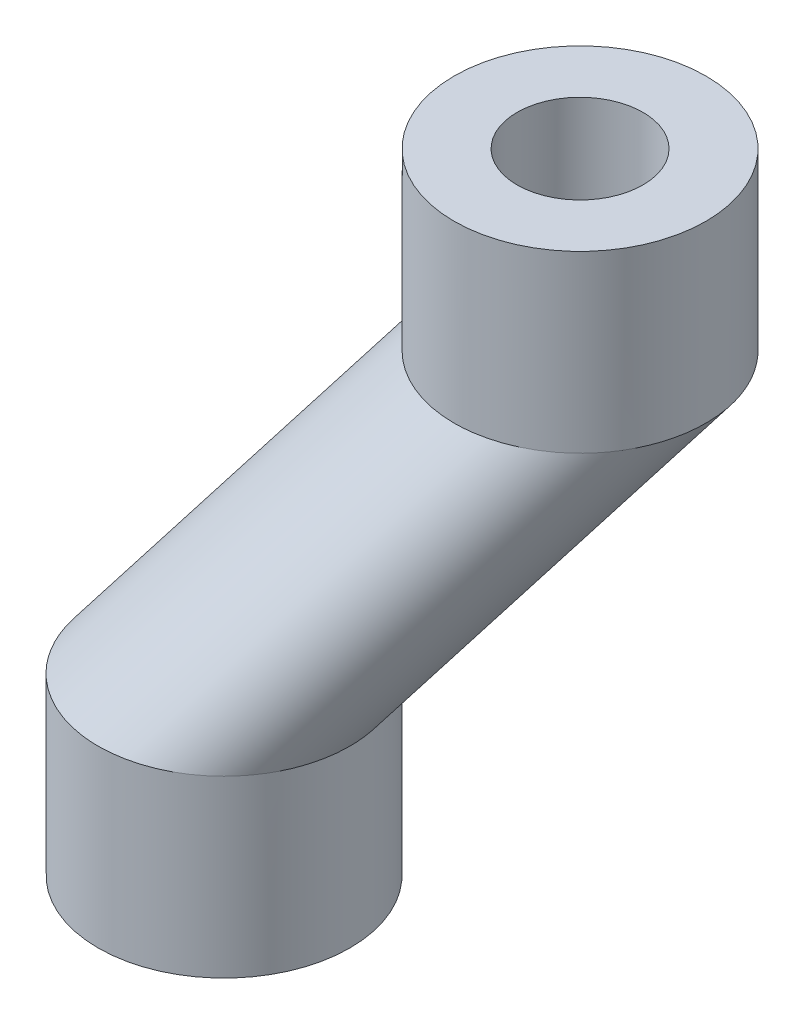
ISO-10303-21;
HEADER;
FILE_DESCRIPTION(('STEP AP214'),'2;1');
FILE_NAME('part.step','',(''),(''),'','','');
FILE_SCHEMA(('AUTOMOTIVE_DESIGN { 1 0 10303 214 1 1 1 1 }'));
ENDSEC;
DATA;
#1=APPLICATION_CONTEXT('core data for automotive mechanical design processes');
#2=APPLICATION_PROTOCOL_DEFINITION('international standard','automotive_design',2000,#1);
#3=PRODUCT_CONTEXT('',#1,'mechanical');
#4=PRODUCT('Part','Part','',(#3));
#5=PRODUCT_RELATED_PRODUCT_CATEGORY('part','',(#4));
#6=PRODUCT_DEFINITION_FORMATION('','',#4);
#7=PRODUCT_DEFINITION_CONTEXT('part definition',#1,'design');
#8=PRODUCT_DEFINITION('design','',#6,#7);
#9=PRODUCT_DEFINITION_SHAPE('','',#8);
#10=(LENGTH_UNIT() NAMED_UNIT(*) SI_UNIT(.MILLI.,.METRE.));
#11=(NAMED_UNIT(*) PLANE_ANGLE_UNIT() SI_UNIT($,.RADIAN.));
#12=(NAMED_UNIT(*) SI_UNIT($,.STERADIAN.) SOLID_ANGLE_UNIT());
#13=UNCERTAINTY_MEASURE_WITH_UNIT(LENGTH_MEASURE(1.E-05),#10,'distance_accuracy_value','');
#14=(GEOMETRIC_REPRESENTATION_CONTEXT(3) GLOBAL_UNCERTAINTY_ASSIGNED_CONTEXT((#13)) GLOBAL_UNIT_ASSIGNED_CONTEXT((#10,
#11,#12)) REPRESENTATION_CONTEXT('',''));
#15=CARTESIAN_POINT('',(0.,0.,0.));
#16=DIRECTION('',(0.,0.,1.));
#17=DIRECTION('',(1.,0.,0.));
#18=AXIS2_PLACEMENT_3D('',#15,#16,#17);
#19=CARTESIAN_POINT('',(0.,0.,18.));
#20=CARTESIAN_POINT('',(25.4558441227157,40.,-7.45584412271576));
#21=CARTESIAN_POINT('',(-0.749999999999999,0.,18.));
#22=CARTESIAN_POINT('',(24.7058441227157,40.,-7.45584412271576));
#23=CARTESIAN_POINT('',(-1.54734121700995,0.,17.9534810870076));
#24=CARTESIAN_POINT('',(23.9085029057057,40.,-7.50236303570817));
#25=CARTESIAN_POINT('',(-3.23141984493696,0.,17.7279348421959));
#26=CARTESIAN_POINT('',(22.2244242777787,40.,-7.72790928051982));
#27=CARTESIAN_POINT('',(-4.1184,0.,17.5488));
#28=CARTESIAN_POINT('',(21.3374441227157,40.,-7.90704412271576));
#29=CARTESIAN_POINT('',(-5.9616,0.,17.0112));
#30=CARTESIAN_POINT('',(19.4942441227157,40.,-8.44464412271576));
#31=CARTESIAN_POINT('',(-6.91806590077011,0.,16.6524428733746));
#32=CARTESIAN_POINT('',(18.5377782219456,40.,-8.80340124934119));
#33=CARTESIAN_POINT('',(-8.8572149981063,0.,15.7071076884232));
#34=CARTESIAN_POINT('',(16.5986291246094,40.,-9.74873643429258));
#35=CARTESIAN_POINT('',(-9.84000000000001,0.,15.12));
#36=CARTESIAN_POINT('',(15.6158441227157,40.,-10.3358441227158));
#37=CARTESIAN_POINT('',(-11.76,0.,13.68));
#38=CARTESIAN_POINT('',(13.6958441227157,40.,-11.7758441227158));
#39=CARTESIAN_POINT('',(-12.6969412647776,0.,12.8264214674423));
#40=CARTESIAN_POINT('',(12.758902857938,40.,-12.6294226552735));
#41=CARTESIAN_POINT('',(-14.4263464064552,0.,10.84481140927));
#42=CARTESIAN_POINT('',(11.0294977162604,40.,-14.6110327134457));
#43=CARTESIAN_POINT('',(-15.2179930795848,0.,9.71626297577855));
#44=CARTESIAN_POINT('',(10.2378510431309,40.,-15.7395811469372));
#45=CARTESIAN_POINT('',(-16.5467128027682,0.,7.22491349480969));
#46=CARTESIAN_POINT('',(8.9091313199475,40.,-18.2309306279061));
#47=CARTESIAN_POINT('',(-17.0826035502959,0.,5.86224852071006));
#48=CARTESIAN_POINT('',(8.3732405724198,40.,-19.5935956020057));
#49=CARTESIAN_POINT('',(-17.8097041420118,0.,2.9992899408284));
#50=CARTESIAN_POINT('',(7.64613998070383,40.,-22.4565541818874));
#51=CARTESIAN_POINT('',(-18.,0.,1.5));
#52=CARTESIAN_POINT('',(7.45584412271567,40.,-23.9558441227157));
#53=CARTESIAN_POINT('',(-18.,0.,-1.5));
#54=CARTESIAN_POINT('',(7.45584412271567,40.,-26.9558441227158));
#55=CARTESIAN_POINT('',(-17.8097041420118,0.,-2.9992899408284));
#56=CARTESIAN_POINT('',(7.64613998070384,40.,-28.4551340635441));
#57=CARTESIAN_POINT('',(-17.0826035502959,0.,-5.86224852071006));
#58=CARTESIAN_POINT('',(8.37324057241981,40.,-31.3180926434258));
#59=CARTESIAN_POINT('',(-16.5467128027682,0.,-7.22491349480969));
#60=CARTESIAN_POINT('',(8.9091313199475,40.,-32.6807576175254));
#61=CARTESIAN_POINT('',(-15.2179930795848,0.,-9.71626297577855));
#62=CARTESIAN_POINT('',(10.2378510431309,40.,-35.1721070984943));
#63=CARTESIAN_POINT('',(-14.4263464064552,0.,-10.84481140927));
#64=CARTESIAN_POINT('',(11.0294977162604,40.,-36.3006555319858));
#65=CARTESIAN_POINT('',(-12.6969412647776,0.,-12.8264214674423));
#66=CARTESIAN_POINT('',(12.758902857938,40.,-38.282265590158));
#67=CARTESIAN_POINT('',(-11.76,0.,-13.68));
#68=CARTESIAN_POINT('',(13.6958441227157,40.,-39.1358441227158));
#69=CARTESIAN_POINT('',(-9.84,0.,-15.12));
#70=CARTESIAN_POINT('',(15.6158441227157,40.,-40.5758441227158));
#71=CARTESIAN_POINT('',(-8.8572149981063,0.,-15.7071076884232));
#72=CARTESIAN_POINT('',(16.5986291246094,40.,-41.1629518111389));
#73=CARTESIAN_POINT('',(-6.9180659007701,0.,-16.6524428733746));
#74=CARTESIAN_POINT('',(18.5377782219456,40.,-42.1082869960903));
#75=CARTESIAN_POINT('',(-5.9616,0.,-17.0112));
#76=CARTESIAN_POINT('',(19.4942441227157,40.,-42.4670441227158));
#77=CARTESIAN_POINT('',(-4.1184,0.,-17.5488));
#78=CARTESIAN_POINT('',(21.3374441227157,40.,-43.0046441227158));
#79=CARTESIAN_POINT('',(-3.23141984493695,0.,-17.7279348421959));
#80=CARTESIAN_POINT('',(22.2244242777787,40.,-43.1837789649117));
#81=CARTESIAN_POINT('',(-1.54734121700994,0.,-17.9534810870076));
#82=CARTESIAN_POINT('',(23.9085029057057,40.,-43.4093252097233));
#83=CARTESIAN_POINT('',(-0.749999999999998,0.,-18.));
#84=CARTESIAN_POINT('',(24.7058441227157,40.,-43.4558441227157));
#85=CARTESIAN_POINT('',(0.750000000000002,0.,-18.));
#86=CARTESIAN_POINT('',(26.2058441227157,40.,-43.4558441227157));
#87=CARTESIAN_POINT('',(1.54734121700995,0.,-17.9534810870076));
#88=CARTESIAN_POINT('',(27.0031853397256,40.,-43.4093252097233));
#89=CARTESIAN_POINT('',(3.23141984493696,0.,-17.7279348421959));
#90=CARTESIAN_POINT('',(28.6872639676526,40.,-43.1837789649117));
#91=CARTESIAN_POINT('',(4.1184,0.,-17.5488));
#92=CARTESIAN_POINT('',(29.5742441227157,40.,-43.0046441227158));
#93=CARTESIAN_POINT('',(5.9616,0.,-17.0112));
#94=CARTESIAN_POINT('',(31.4174441227157,40.,-42.4670441227158));
#95=CARTESIAN_POINT('',(6.91806590077011,0.,-16.6524428733746));
#96=CARTESIAN_POINT('',(32.3739100234858,40.,-42.1082869960903));
#97=CARTESIAN_POINT('',(8.8572149981063,0.,-15.7071076884232));
#98=CARTESIAN_POINT('',(34.313059120822,40.,-41.1629518111389));
#99=CARTESIAN_POINT('',(9.84,0.,-15.12));
#100=CARTESIAN_POINT('',(35.2958441227157,40.,-40.5758441227158));
#101=CARTESIAN_POINT('',(11.76,0.,-13.68));
#102=CARTESIAN_POINT('',(37.2158441227156,40.,-39.1358441227158));
#103=CARTESIAN_POINT('',(12.6969412647776,0.,-12.8264214674423));
#104=CARTESIAN_POINT('',(38.1527853874933,40.,-38.282265590158));
#105=CARTESIAN_POINT('',(14.4263464064552,0.,-10.84481140927));
#106=CARTESIAN_POINT('',(39.8821905291709,40.,-36.3006555319858));
#107=CARTESIAN_POINT('',(15.2179930795848,0.,-9.71626297577855));
#108=CARTESIAN_POINT('',(40.6738372023004,40.,-35.1721070984943));
#109=CARTESIAN_POINT('',(16.5467128027682,0.,-7.22491349480969));
#110=CARTESIAN_POINT('',(42.0025569254838,40.,-32.6807576175254));
#111=CARTESIAN_POINT('',(17.0826035502959,0.,-5.86224852071007));
#112=CARTESIAN_POINT('',(42.5384476730115,40.,-31.3180926434258));
#113=CARTESIAN_POINT('',(17.8097041420118,0.,-2.9992899408284));
#114=CARTESIAN_POINT('',(43.2655482647275,40.,-28.4551340635442));
#115=CARTESIAN_POINT('',(18.,0.,-1.49999999999999));
#116=CARTESIAN_POINT('',(43.4558441227157,40.,-26.9558441227158));
#117=CARTESIAN_POINT('',(18.,0.,1.5));
#118=CARTESIAN_POINT('',(43.4558441227157,40.,-23.9558441227157));
#119=CARTESIAN_POINT('',(17.8097041420118,0.,2.99928994082841));
#120=CARTESIAN_POINT('',(43.2655482647275,40.,-22.4565541818874));
#121=CARTESIAN_POINT('',(17.0826035502959,0.,5.86224852071006));
#122=CARTESIAN_POINT('',(42.5384476730115,40.,-19.5935956020057));
#123=CARTESIAN_POINT('',(16.5467128027682,0.,7.22491349480969));
#124=CARTESIAN_POINT('',(42.0025569254838,40.,-18.2309306279061));
#125=CARTESIAN_POINT('',(15.2179930795848,0.,9.71626297577855));
#126=CARTESIAN_POINT('',(40.6738372023004,40.,-15.7395811469372));
#127=CARTESIAN_POINT('',(14.4263464064552,0.,10.84481140927));
#128=CARTESIAN_POINT('',(39.8821905291709,40.,-14.6110327134457));
#129=CARTESIAN_POINT('',(12.6969412647776,0.,12.8264214674423));
#130=CARTESIAN_POINT('',(38.1527853874933,40.,-12.6294226552735));
#131=CARTESIAN_POINT('',(11.76,0.,13.68));
#132=CARTESIAN_POINT('',(37.2158441227157,40.,-11.7758441227158));
#133=CARTESIAN_POINT('',(9.84,0.,15.12));
#134=CARTESIAN_POINT('',(35.2958441227157,40.,-10.3358441227158));
#135=CARTESIAN_POINT('',(8.8572149981063,0.,15.7071076884232));
#136=CARTESIAN_POINT('',(34.313059120822,40.,-9.74873643429259));
#137=CARTESIAN_POINT('',(6.91806590077011,0.,16.6524428733746));
#138=CARTESIAN_POINT('',(32.3739100234858,40.,-8.80340124934119));
#139=CARTESIAN_POINT('',(5.9616,0.,17.0112));
#140=CARTESIAN_POINT('',(31.4174441227157,40.,-8.44464412271576));
#141=CARTESIAN_POINT('',(4.1184,0.,17.5488));
#142=CARTESIAN_POINT('',(29.5742441227157,40.,-7.90704412271576));
#143=CARTESIAN_POINT('',(3.23141984493695,0.,17.7279348421959));
#144=CARTESIAN_POINT('',(28.6872639676526,40.,-7.72790928051982));
#145=CARTESIAN_POINT('',(1.54734121700995,0.,17.9534810870076));
#146=CARTESIAN_POINT('',(27.0031853397256,40.,-7.50236303570817));
#147=CARTESIAN_POINT('',(0.750000000000003,0.,18.));
#148=CARTESIAN_POINT('',(26.2058441227157,40.,-7.45584412271576));
#149=CARTESIAN_POINT('',(0.,0.,18.));
#150=CARTESIAN_POINT('',(25.4558441227157,40.,-7.45584412271576));
#151=B_SPLINE_SURFACE_WITH_KNOTS('',3,1,((#19,#20),(#21,#22),(#23,#24),(#25,#26),(#27,#28),(#29,
#30),(#31,#32),(#33,#34),(#35,#36),(#37,#38),(#39,#40),(#41,#42),(#43,#44),(#45,#46),(#47,#48),
(#49,#50),(#51,#52),(#53,#54),(#55,#56),(#57,#58),(#59,#60),(#61,#62),(#63,#64),(#65,#66),(#67,
#68),(#69,#70),(#71,#72),(#73,#74),(#75,#76),(#77,#78),(#79,#80),(#81,#82),(#83,#84),(#85,#86),
(#87,#88),(#89,#90),(#91,#92),(#93,#94),(#95,#96),(#97,#98),(#99,#100),(#101,#102),(#103,#104),
(#105,#106),(#107,#108),(#109,#110),(#111,#112),(#113,#114),(#115,#116),(#117,#118),(#119,#120),
(#121,#122),(#123,#124),(#125,#126),(#127,#128),(#129,#130),(#131,#132),(#133,#134),(#135,#136),
(#137,#138),(#139,#140),(#141,#142),(#143,#144),(#145,#146),(#147,#148),(#149,#150)),
.UNSPECIFIED.,.T.,.F.,.F.,(4,2,2,2,2,2,2,2,2,2,2,2,2,2,2,2,2,2,2,2,2,2,2,2,2,2,2,2,2,2,2,2,4),
(2,2),(0.,0.03125,0.0625,0.09375,0.125,0.15625,0.1875,0.21875,0.25,0.28125,0.3125,0.34375,0.375,
0.40625,0.4375,0.46875,0.5,0.53125,0.5625,0.59375,0.625,0.65625,0.6875,0.71875,0.75,0.78125,
0.8125,0.84375,0.875,0.90625,0.9375,0.96875,1.),(0.,1.),.UNSPECIFIED.);
#152=CARTESIAN_POINT('',(0.,0.,18.));
#153=CARTESIAN_POINT('',(0.750000000000003,0.,18.));
#154=CARTESIAN_POINT('',(1.54734121700995,0.,17.9534810870076));
#155=CARTESIAN_POINT('',(3.23141984493695,0.,17.7279348421959));
#156=CARTESIAN_POINT('',(4.1184,0.,17.5488));
#157=CARTESIAN_POINT('',(5.9616,0.,17.0112));
#158=CARTESIAN_POINT('',(6.91806590077011,0.,16.6524428733746));
#159=CARTESIAN_POINT('',(8.8572149981063,0.,15.7071076884232));
#160=CARTESIAN_POINT('',(9.84,0.,15.12));
#161=CARTESIAN_POINT('',(11.76,0.,13.68));
#162=CARTESIAN_POINT('',(12.6969412647776,0.,12.8264214674423));
#163=CARTESIAN_POINT('',(14.4263464064552,0.,10.84481140927));
#164=CARTESIAN_POINT('',(15.2179930795848,0.,9.71626297577855));
#165=CARTESIAN_POINT('',(16.5467128027682,0.,7.22491349480969));
#166=CARTESIAN_POINT('',(17.0826035502959,0.,5.86224852071006));
#167=CARTESIAN_POINT('',(17.8097041420118,0.,2.99928994082841));
#168=CARTESIAN_POINT('',(18.,0.,1.5));
#169=CARTESIAN_POINT('',(18.,0.,-1.49999999999999));
#170=CARTESIAN_POINT('',(17.8097041420118,0.,-2.9992899408284));
#171=CARTESIAN_POINT('',(17.0826035502959,0.,-5.86224852071007));
#172=CARTESIAN_POINT('',(16.5467128027682,0.,-7.22491349480969));
#173=CARTESIAN_POINT('',(15.2179930795848,0.,-9.71626297577855));
#174=CARTESIAN_POINT('',(14.4263464064552,0.,-10.84481140927));
#175=CARTESIAN_POINT('',(12.6969412647776,0.,-12.8264214674423));
#176=CARTESIAN_POINT('',(11.76,0.,-13.68));
#177=CARTESIAN_POINT('',(9.84,0.,-15.12));
#178=CARTESIAN_POINT('',(8.8572149981063,0.,-15.7071076884232));
#179=CARTESIAN_POINT('',(6.91806590077011,0.,-16.6524428733746));
#180=CARTESIAN_POINT('',(5.9616,0.,-17.0112));
#181=CARTESIAN_POINT('',(4.1184,0.,-17.5488));
#182=CARTESIAN_POINT('',(3.23141984493696,0.,-17.7279348421959));
#183=CARTESIAN_POINT('',(1.54734121700995,0.,-17.9534810870076));
#184=CARTESIAN_POINT('',(0.750000000000002,0.,-18.));
#185=CARTESIAN_POINT('',(-0.749999999999998,0.,-18.));
#186=CARTESIAN_POINT('',(-1.54734121700994,0.,-17.9534810870076));
#187=CARTESIAN_POINT('',(-3.23141984493695,0.,-17.7279348421959));
#188=CARTESIAN_POINT('',(-4.1184,0.,-17.5488));
#189=CARTESIAN_POINT('',(-5.9616,0.,-17.0112));
#190=CARTESIAN_POINT('',(-6.9180659007701,0.,-16.6524428733746));
#191=CARTESIAN_POINT('',(-8.8572149981063,0.,-15.7071076884232));
#192=CARTESIAN_POINT('',(-9.84,0.,-15.12));
#193=CARTESIAN_POINT('',(-11.76,0.,-13.68));
#194=CARTESIAN_POINT('',(-12.6969412647776,0.,-12.8264214674423));
#195=CARTESIAN_POINT('',(-14.4263464064552,0.,-10.84481140927));
#196=CARTESIAN_POINT('',(-15.2179930795848,0.,-9.71626297577855));
#197=CARTESIAN_POINT('',(-16.5467128027682,0.,-7.22491349480969));
#198=CARTESIAN_POINT('',(-17.0826035502959,0.,-5.86224852071006));
#199=CARTESIAN_POINT('',(-17.8097041420118,0.,-2.9992899408284));
#200=CARTESIAN_POINT('',(-18.,0.,-1.5));
#201=CARTESIAN_POINT('',(-18.,0.,1.5));
#202=CARTESIAN_POINT('',(-17.8097041420118,0.,2.9992899408284));
#203=CARTESIAN_POINT('',(-17.0826035502959,0.,5.86224852071006));
#204=CARTESIAN_POINT('',(-16.5467128027682,0.,7.22491349480969));
#205=CARTESIAN_POINT('',(-15.2179930795848,0.,9.71626297577855));
#206=CARTESIAN_POINT('',(-14.4263464064552,0.,10.84481140927));
#207=CARTESIAN_POINT('',(-12.6969412647776,0.,12.8264214674423));
#208=CARTESIAN_POINT('',(-11.76,0.,13.68));
#209=CARTESIAN_POINT('',(-9.84000000000001,0.,15.12));
#210=CARTESIAN_POINT('',(-8.8572149981063,0.,15.7071076884232));
#211=CARTESIAN_POINT('',(-6.91806590077011,0.,16.6524428733746));
#212=CARTESIAN_POINT('',(-5.9616,0.,17.0112));
#213=CARTESIAN_POINT('',(-4.1184,0.,17.5488));
#214=CARTESIAN_POINT('',(-3.23141984493696,0.,17.7279348421959));
#215=CARTESIAN_POINT('',(-1.54734121700995,0.,17.9534810870076));
#216=CARTESIAN_POINT('',(-0.749999999999999,0.,18.));
#217=CARTESIAN_POINT('',(0.,0.,18.));
#218=B_SPLINE_CURVE_WITH_KNOTS('',3,(#152,#153,#154,#155,#156,#157,#158,#159,#160,#161,#162,
#163,#164,#165,#166,#167,#168,#169,#170,#171,#172,#173,#174,#175,#176,#177,#178,#179,#180,#181,
#182,#183,#184,#185,#186,#187,#188,#189,#190,#191,#192,#193,#194,#195,#196,#197,#198,#199,#200,
#201,#202,#203,#204,#205,#206,#207,#208,#209,#210,#211,#212,#213,#214,#215,#216,#217),
.UNSPECIFIED.,.T.,.F.,(4,2,2,2,2,2,2,2,2,2,2,2,2,2,2,2,2,2,2,2,2,2,2,2,2,2,2,2,2,2,2,2,4),(0.,
0.0312500000000001,0.0625000000000001,0.0937500000000001,0.125,0.15625,0.1875,0.21875,0.25,
0.28125,0.3125,0.34375,0.375,0.40625,0.4375,0.46875,0.5,0.53125,0.5625,0.59375,0.625,0.65625,
0.6875,0.71875,0.75,0.78125,0.8125,0.84375,0.875,0.90625,0.9375,0.96875,1.),.UNSPECIFIED.);
#219=CARTESIAN_POINT('',(0.,0.,18.));
#220=VERTEX_POINT('',#219);
#221=EDGE_CURVE('E76',#220,#220,#218,.F.);
#222=CARTESIAN_POINT('',(25.4558441227157,40.,-7.45584412271575));
#223=CARTESIAN_POINT('',(24.7058441227157,40.,-7.45584412271575));
#224=CARTESIAN_POINT('',(23.9085029057057,40.,-7.50236303570816));
#225=CARTESIAN_POINT('',(22.2244242777787,40.,-7.72790928051981));
#226=CARTESIAN_POINT('',(21.3374441227157,40.,-7.90704412271575));
#227=CARTESIAN_POINT('',(19.4942441227157,40.,-8.44464412271575));
#228=CARTESIAN_POINT('',(18.5377782219456,40.,-8.80340124934118));
#229=CARTESIAN_POINT('',(16.5986291246094,40.,-9.74873643429257));
#230=CARTESIAN_POINT('',(15.6158441227157,40.,-10.3358441227157));
#231=CARTESIAN_POINT('',(13.6958441227157,40.,-11.7758441227158));
#232=CARTESIAN_POINT('',(12.758902857938,40.,-12.6294226552735));
#233=CARTESIAN_POINT('',(11.0294977162604,40.,-14.6110327134457));
#234=CARTESIAN_POINT('',(10.2378510431309,40.,-15.7395811469372));
#235=CARTESIAN_POINT('',(8.90913131994749,40.,-18.2309306279061));
#236=CARTESIAN_POINT('',(8.3732405724198,40.,-19.5935956020057));
#237=CARTESIAN_POINT('',(7.64613998070383,40.,-22.4565541818873));
#238=CARTESIAN_POINT('',(7.45584412271566,40.,-23.9558441227157));
#239=CARTESIAN_POINT('',(7.45584412271566,40.,-26.9558441227158));
#240=CARTESIAN_POINT('',(7.64613998070383,40.,-28.4551340635441));
#241=CARTESIAN_POINT('',(8.3732405724198,40.,-31.3180926434258));
#242=CARTESIAN_POINT('',(8.90913131994749,40.,-32.6807576175254));
#243=CARTESIAN_POINT('',(10.2378510431309,40.,-35.1721070984943));
#244=CARTESIAN_POINT('',(11.0294977162604,40.,-36.3006555319858));
#245=CARTESIAN_POINT('',(12.758902857938,40.,-38.282265590158));
#246=CARTESIAN_POINT('',(13.6958441227157,40.,-39.1358441227158));
#247=CARTESIAN_POINT('',(15.6158441227156,40.,-40.5758441227158));
#248=CARTESIAN_POINT('',(16.5986291246094,40.,-41.1629518111389));
#249=CARTESIAN_POINT('',(18.5377782219455,40.,-42.1082869960903));
#250=CARTESIAN_POINT('',(19.4942441227156,40.,-42.4670441227158));
#251=CARTESIAN_POINT('',(21.3374441227156,40.,-43.0046441227158));
#252=CARTESIAN_POINT('',(22.2244242777787,40.,-43.1837789649117));
#253=CARTESIAN_POINT('',(23.9085029057057,40.,-43.4093252097233));
#254=CARTESIAN_POINT('',(24.7058441227157,40.,-43.4558441227157));
#255=CARTESIAN_POINT('',(26.2058441227156,40.,-43.4558441227157));
#256=CARTESIAN_POINT('',(27.0031853397256,40.,-43.4093252097233));
#257=CARTESIAN_POINT('',(28.6872639676526,40.,-43.1837789649117));
#258=CARTESIAN_POINT('',(29.5742441227157,40.,-43.0046441227158));
#259=CARTESIAN_POINT('',(31.4174441227157,40.,-42.4670441227157));
#260=CARTESIAN_POINT('',(32.3739100234857,40.,-42.1082869960903));
#261=CARTESIAN_POINT('',(34.313059120822,40.,-41.1629518111389));
#262=CARTESIAN_POINT('',(35.2958441227156,40.,-40.5758441227158));
#263=CARTESIAN_POINT('',(37.2158441227156,40.,-39.1358441227158));
#264=CARTESIAN_POINT('',(38.1527853874933,40.,-38.282265590158));
#265=CARTESIAN_POINT('',(39.8821905291709,40.,-36.3006555319858));
#266=CARTESIAN_POINT('',(40.6738372023004,40.,-35.1721070984943));
#267=CARTESIAN_POINT('',(42.0025569254838,40.,-32.6807576175254));
#268=CARTESIAN_POINT('',(42.5384476730115,40.,-31.3180926434258));
#269=CARTESIAN_POINT('',(43.2655482647275,40.,-28.4551340635442));
#270=CARTESIAN_POINT('',(43.4558441227157,40.,-26.9558441227157));
#271=CARTESIAN_POINT('',(43.4558441227157,40.,-23.9558441227157));
#272=CARTESIAN_POINT('',(43.2655482647275,40.,-22.4565541818874));
#273=CARTESIAN_POINT('',(42.5384476730115,40.,-19.5935956020057));
#274=CARTESIAN_POINT('',(42.0025569254838,40.,-18.2309306279061));
#275=CARTESIAN_POINT('',(40.6738372023004,40.,-15.7395811469372));
#276=CARTESIAN_POINT('',(39.8821905291709,40.,-14.6110327134457));
#277=CARTESIAN_POINT('',(38.1527853874933,40.,-12.6294226552735));
#278=CARTESIAN_POINT('',(37.2158441227157,40.,-11.7758441227158));
#279=CARTESIAN_POINT('',(35.2958441227157,40.,-10.3358441227157));
#280=CARTESIAN_POINT('',(34.313059120822,40.,-9.74873643429258));
#281=CARTESIAN_POINT('',(32.3739100234858,40.,-8.80340124934118));
#282=CARTESIAN_POINT('',(31.4174441227157,40.,-8.44464412271575));
#283=CARTESIAN_POINT('',(29.5742441227156,40.,-7.90704412271575));
#284=CARTESIAN_POINT('',(28.6872639676526,40.,-7.72790928051981));
#285=CARTESIAN_POINT('',(27.0031853397256,40.,-7.50236303570816));
#286=CARTESIAN_POINT('',(26.2058441227157,40.,-7.45584412271575));
#287=CARTESIAN_POINT('',(25.4558441227157,40.,-7.45584412271575));
#288=B_SPLINE_CURVE_WITH_KNOTS('',3,(#222,#223,#224,#225,#226,#227,#228,#229,#230,#231,#232,
#233,#234,#235,#236,#237,#238,#239,#240,#241,#242,#243,#244,#245,#246,#247,#248,#249,#250,#251,
#252,#253,#254,#255,#256,#257,#258,#259,#260,#261,#262,#263,#264,#265,#266,#267,#268,#269,#270,
#271,#272,#273,#274,#275,#276,#277,#278,#279,#280,#281,#282,#283,#284,#285,#286,#287),
.UNSPECIFIED.,.T.,.F.,(4,2,2,2,2,2,2,2,2,2,2,2,2,2,2,2,2,2,2,2,2,2,2,2,2,2,2,2,2,2,2,2,4),(0.,
0.03125,0.0625,0.09375,0.125,0.15625,0.1875,0.21875,0.25,0.28125,0.3125,0.34375,0.375,0.40625,
0.4375,0.46875,0.5,0.53125,0.5625,0.59375,0.625,0.65625,0.6875,0.71875,0.75,0.78125,0.8125,
0.84375,0.875,0.90625,0.9375,0.96875,1.),.UNSPECIFIED.);
#289=CARTESIAN_POINT('',(25.4558441227157,40.,-7.45584412271575));
#290=VERTEX_POINT('',#289);
#291=EDGE_CURVE('E11',#290,#290,#288,.F.);
#292=ORIENTED_EDGE('',*,*,#221,.F.);
#293=EDGE_LOOP('',(#292));
#294=FACE_BOUND('',#293,.T.);
#295=ORIENTED_EDGE('',*,*,#291,.F.);
#296=EDGE_LOOP('',(#295));
#297=FACE_BOUND('',#296,.T.);
#298=ADVANCED_FACE('F65',(#294,#297),#151,.F.);
#299=CARTESIAN_POINT('',(0.,0.,9.));
#300=CARTESIAN_POINT('',(25.4558441227157,40.,-16.4558441227158));
#301=CARTESIAN_POINT('',(-0.375,0.,9.));
#302=CARTESIAN_POINT('',(25.0808441227157,40.,-16.4558441227158));
#303=CARTESIAN_POINT('',(-0.773670608504973,0.,8.97674054350379));
#304=CARTESIAN_POINT('',(24.6821735142107,40.,-16.479103579212));
#305=CARTESIAN_POINT('',(-1.61570992246848,0.,8.86396742109797));
#306=CARTESIAN_POINT('',(23.8401342002472,40.,-16.5918767016178));
#307=CARTESIAN_POINT('',(-2.0592,0.,8.7744));
#308=CARTESIAN_POINT('',(23.3966441227157,40.,-16.6814441227158));
#309=CARTESIAN_POINT('',(-2.9808,0.,8.5056));
#310=CARTESIAN_POINT('',(22.4750441227157,40.,-16.9502441227158));
#311=CARTESIAN_POINT('',(-3.45903295038505,0.,8.32622143668729));
#312=CARTESIAN_POINT('',(21.9968111723306,40.,-17.1296226860285));
#313=CARTESIAN_POINT('',(-4.42860749905315,0.,7.85355384421159));
#314=CARTESIAN_POINT('',(21.0272366236625,40.,-17.6022902785042));
#315=CARTESIAN_POINT('',(-4.92,0.,7.56));
#316=CARTESIAN_POINT('',(20.5358441227157,40.,-17.8958441227158));
#317=CARTESIAN_POINT('',(-5.88,0.,6.84));
#318=CARTESIAN_POINT('',(19.5758441227157,40.,-18.6158441227158));
#319=CARTESIAN_POINT('',(-6.34847063238881,0.,6.41321073372115));
#320=CARTESIAN_POINT('',(19.1073734903269,40.,-19.0426333889946));
#321=CARTESIAN_POINT('',(-7.21317320322762,0.,5.42240570463502));
#322=CARTESIAN_POINT('',(18.242670919488,40.,-20.0334384180807));
#323=CARTESIAN_POINT('',(-7.60899653979239,0.,4.85813148788927));
#324=CARTESIAN_POINT('',(17.8468475829233,40.,-20.5977126348265));
#325=CARTESIAN_POINT('',(-8.27335640138408,0.,3.61245674740484));
#326=CARTESIAN_POINT('',(17.1824877213316,40.,-21.8433873753109));
#327=CARTESIAN_POINT('',(-8.54130177514793,0.,2.93112426035503));
#328=CARTESIAN_POINT('',(16.9145423475677,40.,-22.5247198623607));
#329=CARTESIAN_POINT('',(-8.90485207100591,0.,1.4996449704142));
#330=CARTESIAN_POINT('',(16.5509920517097,40.,-23.9561991523016));
#331=CARTESIAN_POINT('',(-9.,0.,0.749999999999999));
#332=CARTESIAN_POINT('',(16.4558441227157,40.,-24.7058441227158));
#333=CARTESIAN_POINT('',(-8.99999999999999,0.,-0.75));
#334=CARTESIAN_POINT('',(16.4558441227157,40.,-26.2058441227158));
#335=CARTESIAN_POINT('',(-8.90485207100591,0.,-1.4996449704142));
#336=CARTESIAN_POINT('',(16.5509920517097,40.,-26.95548909313));
#337=CARTESIAN_POINT('',(-8.54130177514793,0.,-2.93112426035503));
#338=CARTESIAN_POINT('',(16.9145423475677,40.,-28.3869683830708));
#339=CARTESIAN_POINT('',(-8.27335640138408,0.,-3.61245674740484));
#340=CARTESIAN_POINT('',(17.1824877213316,40.,-29.0683008701206));
#341=CARTESIAN_POINT('',(-7.60899653979239,0.,-4.85813148788927));
#342=CARTESIAN_POINT('',(17.8468475829233,40.,-30.313975610605));
#343=CARTESIAN_POINT('',(-7.21317320322762,0.,-5.42240570463502));
#344=CARTESIAN_POINT('',(18.242670919488,40.,-30.8782498273508));
#345=CARTESIAN_POINT('',(-6.34847063238881,0.,-6.41321073372115));
#346=CARTESIAN_POINT('',(19.1073734903268,40.,-31.8690548564369));
#347=CARTESIAN_POINT('',(-5.88,0.,-6.84));
#348=CARTESIAN_POINT('',(19.5758441227157,40.,-32.2958441227158));
#349=CARTESIAN_POINT('',(-4.92,0.,-7.56));
#350=CARTESIAN_POINT('',(20.5358441227157,40.,-33.0158441227157));
#351=CARTESIAN_POINT('',(-4.42860749905315,0.,-7.85355384421159));
#352=CARTESIAN_POINT('',(21.0272366236625,40.,-33.3093979669273));
#353=CARTESIAN_POINT('',(-3.45903295038505,0.,-8.32622143668728));
#354=CARTESIAN_POINT('',(21.9968111723306,40.,-33.782065559403));
#355=CARTESIAN_POINT('',(-2.9808,0.,-8.5056));
#356=CARTESIAN_POINT('',(22.4750441227157,40.,-33.9614441227158));
#357=CARTESIAN_POINT('',(-2.0592,0.,-8.7744));
#358=CARTESIAN_POINT('',(23.3966441227157,40.,-34.2302441227158));
#359=CARTESIAN_POINT('',(-1.61570992246848,0.,-8.86396742109797));
#360=CARTESIAN_POINT('',(23.8401342002472,40.,-34.3198115438137));
#361=CARTESIAN_POINT('',(-0.773670608504971,0.,-8.97674054350379));
#362=CARTESIAN_POINT('',(24.6821735142107,40.,-34.4325846662195));
#363=CARTESIAN_POINT('',(-0.374999999999998,0.,-9.));
#364=CARTESIAN_POINT('',(25.0808441227157,40.,-34.4558441227158));
#365=CARTESIAN_POINT('',(0.375000000000001,0.,-9.));
#366=CARTESIAN_POINT('',(25.8308441227157,40.,-34.4558441227157));
#367=CARTESIAN_POINT('',(0.77367060850497,0.,-8.97674054350379));
#368=CARTESIAN_POINT('',(26.2295147312206,40.,-34.4325846662196));
#369=CARTESIAN_POINT('',(1.61570992246848,0.,-8.86396742109797));
#370=CARTESIAN_POINT('',(27.0715540451841,40.,-34.3198115438137));
#371=CARTESIAN_POINT('',(2.0592,0.,-8.7744));
#372=CARTESIAN_POINT('',(27.5150441227157,40.,-34.2302441227158));
#373=CARTESIAN_POINT('',(2.9808,0.,-8.5056));
#374=CARTESIAN_POINT('',(28.4366441227157,40.,-33.9614441227158));
#375=CARTESIAN_POINT('',(3.45903295038505,0.,-8.32622143668729));
#376=CARTESIAN_POINT('',(28.9148770731007,40.,-33.7820655594031));
#377=CARTESIAN_POINT('',(4.42860749905315,0.,-7.85355384421159));
#378=CARTESIAN_POINT('',(29.8844516217688,40.,-33.3093979669273));
#379=CARTESIAN_POINT('',(4.92000000000001,0.,-7.55999999999999));
#380=CARTESIAN_POINT('',(30.3758441227157,40.,-33.0158441227157));
#381=CARTESIAN_POINT('',(5.87999999999999,0.,-6.84));
#382=CARTESIAN_POINT('',(31.3358441227157,40.,-32.2958441227158));
#383=CARTESIAN_POINT('',(6.34847063238881,0.,-6.41321073372115));
#384=CARTESIAN_POINT('',(31.8043147551045,40.,-31.8690548564369));
#385=CARTESIAN_POINT('',(7.21317320322762,0.,-5.42240570463501));
#386=CARTESIAN_POINT('',(32.6690173259433,40.,-30.8782498273508));
#387=CARTESIAN_POINT('',(7.60899653979239,0.,-4.85813148788927));
#388=CARTESIAN_POINT('',(33.0648406625081,40.,-30.313975610605));
#389=CARTESIAN_POINT('',(8.27335640138408,0.,-3.61245674740484));
#390=CARTESIAN_POINT('',(33.7292005240998,40.,-29.0683008701206));
#391=CARTESIAN_POINT('',(8.54130177514793,0.,-2.93112426035503));
#392=CARTESIAN_POINT('',(33.9971458978636,40.,-28.3869683830708));
#393=CARTESIAN_POINT('',(8.90485207100592,0.,-1.4996449704142));
#394=CARTESIAN_POINT('',(34.3606961937216,40.,-26.95548909313));
#395=CARTESIAN_POINT('',(9.,0.,-0.749999999999994));
#396=CARTESIAN_POINT('',(34.4558441227157,40.,-26.2058441227158));
#397=CARTESIAN_POINT('',(8.99999999999999,0.,0.749999999999997));
#398=CARTESIAN_POINT('',(34.4558441227156,40.,-24.7058441227158));
#399=CARTESIAN_POINT('',(8.90485207100591,0.,1.4996449704142));
#400=CARTESIAN_POINT('',(34.3606961937216,40.,-23.9561991523016));
#401=CARTESIAN_POINT('',(8.54130177514793,0.,2.93112426035503));
#402=CARTESIAN_POINT('',(33.9971458978636,40.,-22.5247198623607));
#403=CARTESIAN_POINT('',(8.27335640138408,0.,3.61245674740484));
#404=CARTESIAN_POINT('',(33.7292005240998,40.,-21.8433873753109));
#405=CARTESIAN_POINT('',(7.60899653979239,0.,4.85813148788927));
#406=CARTESIAN_POINT('',(33.064840662508,40.,-20.5977126348265));
#407=CARTESIAN_POINT('',(7.21317320322762,0.,5.42240570463502));
#408=CARTESIAN_POINT('',(32.6690173259433,40.,-20.0334384180808));
#409=CARTESIAN_POINT('',(6.34847063238881,0.,6.41321073372114));
#410=CARTESIAN_POINT('',(31.8043147551045,40.,-19.0426333889946));
#411=CARTESIAN_POINT('',(5.88,0.,6.84));
#412=CARTESIAN_POINT('',(31.3358441227157,40.,-18.6158441227158));
#413=CARTESIAN_POINT('',(4.92,0.,7.56));
#414=CARTESIAN_POINT('',(30.3758441227156,40.,-17.8958441227157));
#415=CARTESIAN_POINT('',(4.42860749905315,0.,7.85355384421159));
#416=CARTESIAN_POINT('',(29.8844516217688,40.,-17.6022902785042));
#417=CARTESIAN_POINT('',(3.45903295038505,0.,8.32622143668728));
#418=CARTESIAN_POINT('',(28.9148770731007,40.,-17.1296226860285));
#419=CARTESIAN_POINT('',(2.9808,0.,8.5056));
#420=CARTESIAN_POINT('',(28.4366441227157,40.,-16.9502441227158));
#421=CARTESIAN_POINT('',(2.0592,0.,8.7744));
#422=CARTESIAN_POINT('',(27.5150441227157,40.,-16.6814441227158));
#423=CARTESIAN_POINT('',(1.61570992246847,0.,8.86396742109797));
#424=CARTESIAN_POINT('',(27.0715540451841,40.,-16.5918767016178));
#425=CARTESIAN_POINT('',(0.773670608504974,0.,8.97674054350379));
#426=CARTESIAN_POINT('',(26.2295147312206,40.,-16.479103579212));
#427=CARTESIAN_POINT('',(0.375000000000002,0.,9.));
#428=CARTESIAN_POINT('',(25.8308441227157,40.,-16.4558441227158));
#429=CARTESIAN_POINT('',(0.,0.,9.));
#430=CARTESIAN_POINT('',(25.4558441227157,40.,-16.4558441227158));
#431=B_SPLINE_SURFACE_WITH_KNOTS('',3,1,((#299,#300),(#301,#302),(#303,#304),(#305,#306),(#307,
#308),(#309,#310),(#311,#312),(#313,#314),(#315,#316),(#317,#318),(#319,#320),(#321,#322),(#323,
#324),(#325,#326),(#327,#328),(#329,#330),(#331,#332),(#333,#334),(#335,#336),(#337,#338),(#339,
#340),(#341,#342),(#343,#344),(#345,#346),(#347,#348),(#349,#350),(#351,#352),(#353,#354),(#355,
#356),(#357,#358),(#359,#360),(#361,#362),(#363,#364),(#365,#366),(#367,#368),(#369,#370),(#371,
#372),(#373,#374),(#375,#376),(#377,#378),(#379,#380),(#381,#382),(#383,#384),(#385,#386),(#387,
#388),(#389,#390),(#391,#392),(#393,#394),(#395,#396),(#397,#398),(#399,#400),(#401,#402),(#403,
#404),(#405,#406),(#407,#408),(#409,#410),(#411,#412),(#413,#414),(#415,#416),(#417,#418),(#419,
#420),(#421,#422),(#423,#424),(#425,#426),(#427,#428),(#429,#430)),.UNSPECIFIED.,.T.,.F.,.F.,(4,
2,2,2,2,2,2,2,2,2,2,2,2,2,2,2,2,2,2,2,2,2,2,2,2,2,2,2,2,2,2,2,4),(2,2),(0.,0.03125,
0.0624999999999999,0.0937499999999998,0.125,0.15625,0.1875,0.21875,0.25,0.28125,0.3125,0.34375,
0.375,0.40625,0.4375,0.46875,0.5,0.53125,0.562499999999999,0.593749999999999,0.624999999999999,
0.656249999999999,0.687499999999999,0.71875,0.75,0.78125,0.8125,0.84375,0.875,0.90625,0.9375,
0.96875,1.),(0.,1.),.UNSPECIFIED.);
#432=CARTESIAN_POINT('',(0.,0.,9.));
#433=CARTESIAN_POINT('',(-0.375,0.,9.));
#434=CARTESIAN_POINT('',(-0.773670608504973,0.,8.97674054350379));
#435=CARTESIAN_POINT('',(-1.61570992246848,0.,8.86396742109797));
#436=CARTESIAN_POINT('',(-2.0592,0.,8.7744));
#437=CARTESIAN_POINT('',(-2.9808,0.,8.5056));
#438=CARTESIAN_POINT('',(-3.45903295038505,0.,8.32622143668729));
#439=CARTESIAN_POINT('',(-4.42860749905315,0.,7.85355384421159));
#440=CARTESIAN_POINT('',(-4.92,0.,7.56));
#441=CARTESIAN_POINT('',(-5.88,0.,6.84));
#442=CARTESIAN_POINT('',(-6.34847063238881,0.,6.41321073372115));
#443=CARTESIAN_POINT('',(-7.21317320322762,0.,5.42240570463502));
#444=CARTESIAN_POINT('',(-7.60899653979239,0.,4.85813148788927));
#445=CARTESIAN_POINT('',(-8.27335640138408,0.,3.61245674740484));
#446=CARTESIAN_POINT('',(-8.54130177514793,0.,2.93112426035503));
#447=CARTESIAN_POINT('',(-8.90485207100591,0.,1.4996449704142));
#448=CARTESIAN_POINT('',(-9.,0.,0.749999999999999));
#449=CARTESIAN_POINT('',(-8.99999999999999,0.,-0.75));
#450=CARTESIAN_POINT('',(-8.90485207100591,0.,-1.4996449704142));
#451=CARTESIAN_POINT('',(-8.54130177514793,0.,-2.93112426035503));
#452=CARTESIAN_POINT('',(-8.27335640138408,0.,-3.61245674740484));
#453=CARTESIAN_POINT('',(-7.60899653979239,0.,-4.85813148788927));
#454=CARTESIAN_POINT('',(-7.21317320322762,0.,-5.42240570463502));
#455=CARTESIAN_POINT('',(-6.34847063238881,0.,-6.41321073372115));
#456=CARTESIAN_POINT('',(-5.88,0.,-6.84));
#457=CARTESIAN_POINT('',(-4.92,0.,-7.56));
#458=CARTESIAN_POINT('',(-4.42860749905315,0.,-7.85355384421159));
#459=CARTESIAN_POINT('',(-3.45903295038505,0.,-8.32622143668728));
#460=CARTESIAN_POINT('',(-2.9808,0.,-8.5056));
#461=CARTESIAN_POINT('',(-2.0592,0.,-8.7744));
#462=CARTESIAN_POINT('',(-1.61570992246848,0.,-8.86396742109797));
#463=CARTESIAN_POINT('',(-0.773670608504971,0.,-8.97674054350379));
#464=CARTESIAN_POINT('',(-0.374999999999998,0.,-9.));
#465=CARTESIAN_POINT('',(0.375000000000001,0.,-9.));
#466=CARTESIAN_POINT('',(0.77367060850497,0.,-8.97674054350379));
#467=CARTESIAN_POINT('',(1.61570992246848,0.,-8.86396742109797));
#468=CARTESIAN_POINT('',(2.0592,0.,-8.7744));
#469=CARTESIAN_POINT('',(2.9808,0.,-8.5056));
#470=CARTESIAN_POINT('',(3.45903295038505,0.,-8.32622143668729));
#471=CARTESIAN_POINT('',(4.42860749905315,0.,-7.85355384421159));
#472=CARTESIAN_POINT('',(4.92000000000001,0.,-7.55999999999999));
#473=CARTESIAN_POINT('',(5.87999999999999,0.,-6.84));
#474=CARTESIAN_POINT('',(6.34847063238881,0.,-6.41321073372115));
#475=CARTESIAN_POINT('',(7.21317320322762,0.,-5.42240570463501));
#476=CARTESIAN_POINT('',(7.60899653979239,0.,-4.85813148788927));
#477=CARTESIAN_POINT('',(8.27335640138408,0.,-3.61245674740484));
#478=CARTESIAN_POINT('',(8.54130177514793,0.,-2.93112426035503));
#479=CARTESIAN_POINT('',(8.90485207100592,0.,-1.4996449704142));
#480=CARTESIAN_POINT('',(9.,0.,-0.749999999999994));
#481=CARTESIAN_POINT('',(8.99999999999999,0.,0.749999999999997));
#482=CARTESIAN_POINT('',(8.90485207100591,0.,1.4996449704142));
#483=CARTESIAN_POINT('',(8.54130177514793,0.,2.93112426035503));
#484=CARTESIAN_POINT('',(8.27335640138408,0.,3.61245674740484));
#485=CARTESIAN_POINT('',(7.60899653979239,0.,4.85813148788927));
#486=CARTESIAN_POINT('',(7.21317320322762,0.,5.42240570463502));
#487=CARTESIAN_POINT('',(6.34847063238881,0.,6.41321073372114));
#488=CARTESIAN_POINT('',(5.88,0.,6.84));
#489=CARTESIAN_POINT('',(4.92,0.,7.56));
#490=CARTESIAN_POINT('',(4.42860749905315,0.,7.85355384421159));
#491=CARTESIAN_POINT('',(3.45903295038505,0.,8.32622143668728));
#492=CARTESIAN_POINT('',(2.9808,0.,8.5056));
#493=CARTESIAN_POINT('',(2.0592,0.,8.7744));
#494=CARTESIAN_POINT('',(1.61570992246847,0.,8.86396742109797));
#495=CARTESIAN_POINT('',(0.773670608504974,0.,8.97674054350379));
#496=CARTESIAN_POINT('',(0.375000000000002,0.,9.));
#497=CARTESIAN_POINT('',(0.,0.,9.));
#498=B_SPLINE_CURVE_WITH_KNOTS('',3,(#432,#433,#434,#435,#436,#437,#438,#439,#440,#441,#442,
#443,#444,#445,#446,#447,#448,#449,#450,#451,#452,#453,#454,#455,#456,#457,#458,#459,#460,#461,
#462,#463,#464,#465,#466,#467,#468,#469,#470,#471,#472,#473,#474,#475,#476,#477,#478,#479,#480,
#481,#482,#483,#484,#485,#486,#487,#488,#489,#490,#491,#492,#493,#494,#495,#496,#497),
.UNSPECIFIED.,.T.,.F.,(4,2,2,2,2,2,2,2,2,2,2,2,2,2,2,2,2,2,2,2,2,2,2,2,2,2,2,2,2,2,2,2,4),(0.,
0.03125,0.0624999999999999,0.0937499999999998,0.125,0.15625,0.1875,0.21875,0.25,0.28125,0.3125,
0.34375,0.375,0.40625,0.4375,0.46875,0.5,0.53125,0.562499999999999,0.593749999999999,
0.624999999999999,0.656249999999999,0.687499999999999,0.71875,0.75,0.78125,0.8125,0.84375,0.875,
0.90625,0.9375,0.96875,1.),.UNSPECIFIED.);
#499=CARTESIAN_POINT('',(0.,0.,9.));
#500=VERTEX_POINT('',#499);
#501=EDGE_CURVE('E91',#500,#500,#498,.T.);
#502=CARTESIAN_POINT('',(25.4558441227157,40.,-16.4558441227158));
#503=CARTESIAN_POINT('',(25.8308441227156,40.,-16.4558441227158));
#504=CARTESIAN_POINT('',(26.2295147312206,40.,-16.4791035792119));
#505=CARTESIAN_POINT('',(27.0715540451841,40.,-16.5918767016178));
#506=CARTESIAN_POINT('',(27.5150441227157,40.,-16.6814441227158));
#507=CARTESIAN_POINT('',(28.4366441227157,40.,-16.9502441227158));
#508=CARTESIAN_POINT('',(28.9148770731007,40.,-17.1296226860285));
#509=CARTESIAN_POINT('',(29.8844516217688,40.,-17.6022902785042));
#510=CARTESIAN_POINT('',(30.3758441227156,40.,-17.8958441227157));
#511=CARTESIAN_POINT('',(31.3358441227156,40.,-18.6158441227157));
#512=CARTESIAN_POINT('',(31.8043147551045,40.,-19.0426333889946));
#513=CARTESIAN_POINT('',(32.6690173259433,40.,-20.0334384180807));
#514=CARTESIAN_POINT('',(33.064840662508,40.,-20.5977126348265));
#515=CARTESIAN_POINT('',(33.7292005240997,40.,-21.8433873753109));
#516=CARTESIAN_POINT('',(33.9971458978636,40.,-22.5247198623607));
#517=CARTESIAN_POINT('',(34.3606961937216,40.,-23.9561991523016));
#518=CARTESIAN_POINT('',(34.4558441227156,40.,-24.7058441227157));
#519=CARTESIAN_POINT('',(34.4558441227157,40.,-26.2058441227158));
#520=CARTESIAN_POINT('',(34.3606961937216,40.,-26.95548909313));
#521=CARTESIAN_POINT('',(33.9971458978636,40.,-28.3869683830708));
#522=CARTESIAN_POINT('',(33.7292005240998,40.,-29.0683008701206));
#523=CARTESIAN_POINT('',(33.064840662508,40.,-30.313975610605));
#524=CARTESIAN_POINT('',(32.6690173259433,40.,-30.8782498273508));
#525=CARTESIAN_POINT('',(31.8043147551045,40.,-31.8690548564369));
#526=CARTESIAN_POINT('',(31.3358441227157,40.,-32.2958441227157));
#527=CARTESIAN_POINT('',(30.3758441227157,40.,-33.0158441227157));
#528=CARTESIAN_POINT('',(29.8844516217688,40.,-33.3093979669273));
#529=CARTESIAN_POINT('',(28.9148770731007,40.,-33.7820655594031));
#530=CARTESIAN_POINT('',(28.4366441227156,40.,-33.9614441227158));
#531=CARTESIAN_POINT('',(27.5150441227157,40.,-34.2302441227157));
#532=CARTESIAN_POINT('',(27.0715540451841,40.,-34.3198115438137));
#533=CARTESIAN_POINT('',(26.2295147312206,40.,-34.4325846662196));
#534=CARTESIAN_POINT('',(25.8308441227157,40.,-34.4558441227157));
#535=CARTESIAN_POINT('',(25.0808441227156,40.,-34.4558441227158));
#536=CARTESIAN_POINT('',(24.6821735142107,40.,-34.4325846662195));
#537=CARTESIAN_POINT('',(23.8401342002472,40.,-34.3198115438137));
#538=CARTESIAN_POINT('',(23.3966441227157,40.,-34.2302441227157));
#539=CARTESIAN_POINT('',(22.4750441227157,40.,-33.9614441227158));
#540=CARTESIAN_POINT('',(21.9968111723306,40.,-33.782065559403));
#541=CARTESIAN_POINT('',(21.0272366236625,40.,-33.3093979669273));
#542=CARTESIAN_POINT('',(20.5358441227156,40.,-33.0158441227157));
#543=CARTESIAN_POINT('',(19.5758441227156,40.,-32.2958441227157));
#544=CARTESIAN_POINT('',(19.1073734903268,40.,-31.8690548564369));
#545=CARTESIAN_POINT('',(18.242670919488,40.,-30.8782498273508));
#546=CARTESIAN_POINT('',(17.8468475829233,40.,-30.313975610605));
#547=CARTESIAN_POINT('',(17.1824877213316,40.,-29.0683008701206));
#548=CARTESIAN_POINT('',(16.9145423475677,40.,-28.3869683830708));
#549=CARTESIAN_POINT('',(16.5509920517097,40.,-26.95548909313));
#550=CARTESIAN_POINT('',(16.4558441227157,40.,-26.2058441227157));
#551=CARTESIAN_POINT('',(16.4558441227157,40.,-24.7058441227157));
#552=CARTESIAN_POINT('',(16.5509920517097,40.,-23.9561991523016));
#553=CARTESIAN_POINT('',(16.9145423475677,40.,-22.5247198623607));
#554=CARTESIAN_POINT('',(17.1824877213316,40.,-21.8433873753109));
#555=CARTESIAN_POINT('',(17.8468475829233,40.,-20.5977126348265));
#556=CARTESIAN_POINT('',(18.242670919488,40.,-20.0334384180807));
#557=CARTESIAN_POINT('',(19.1073734903268,40.,-19.0426333889946));
#558=CARTESIAN_POINT('',(19.5758441227156,40.,-18.6158441227157));
#559=CARTESIAN_POINT('',(20.5358441227157,40.,-17.8958441227158));
#560=CARTESIAN_POINT('',(21.0272366236625,40.,-17.6022902785042));
#561=CARTESIAN_POINT('',(21.9968111723306,40.,-17.1296226860285));
#562=CARTESIAN_POINT('',(22.4750441227157,40.,-16.9502441227157));
#563=CARTESIAN_POINT('',(23.3966441227157,40.,-16.6814441227157));
#564=CARTESIAN_POINT('',(23.8401342002472,40.,-16.5918767016178));
#565=CARTESIAN_POINT('',(24.6821735142107,40.,-16.4791035792119));
#566=CARTESIAN_POINT('',(25.0808441227157,40.,-16.4558441227157));
#567=CARTESIAN_POINT('',(25.4558441227157,40.,-16.4558441227158));
#568=B_SPLINE_CURVE_WITH_KNOTS('',3,(#502,#503,#504,#505,#506,#507,#508,#509,#510,#511,#512,
#513,#514,#515,#516,#517,#518,#519,#520,#521,#522,#523,#524,#525,#526,#527,#528,#529,#530,#531,
#532,#533,#534,#535,#536,#537,#538,#539,#540,#541,#542,#543,#544,#545,#546,#547,#548,#549,#550,
#551,#552,#553,#554,#555,#556,#557,#558,#559,#560,#561,#562,#563,#564,#565,#566,#567),
.UNSPECIFIED.,.T.,.F.,(4,2,2,2,2,2,2,2,2,2,2,2,2,2,2,2,2,2,2,2,2,2,2,2,2,2,2,2,2,2,2,2,4),(0.,
0.0312500000000001,0.0625000000000001,0.0937500000000001,0.125,0.15625,0.1875,0.21875,0.25,
0.28125,0.312500000000001,0.343750000000001,0.375000000000001,0.406250000000001,
0.437500000000001,0.46875,0.5,0.53125,0.5625,0.59375,0.625,0.65625,0.6875,0.71875,0.75,0.78125,
0.8125,0.84375,0.875,0.90625,0.9375,0.96875,1.),.UNSPECIFIED.);
#569=CARTESIAN_POINT('',(25.4558441227157,40.,-16.4558441227158));
#570=VERTEX_POINT('',#569);
#571=EDGE_CURVE('E150',#570,#570,#568,.T.);
#572=ORIENTED_EDGE('',*,*,#501,.T.);
#573=EDGE_LOOP('',(#572));
#574=FACE_BOUND('',#573,.T.);
#575=ORIENTED_EDGE('',*,*,#571,.T.);
#576=EDGE_LOOP('',(#575));
#577=FACE_BOUND('',#576,.T.);
#578=ADVANCED_FACE('F114',(#574,#577),#431,.T.);
#579=CARTESIAN_POINT('',(0.,-25.,0.));
#580=DIRECTION('',(0.,-1.,0.));
#581=DIRECTION('',(0.,0.,-1.));
#582=AXIS2_PLACEMENT_3D('',#579,#580,#581);
#583=PLANE('',#582);
#584=CARTESIAN_POINT('',(0.,-25.,0.));
#585=DIRECTION('',(0.,-1.,0.));
#586=DIRECTION('',(0.,0.,-1.));
#587=AXIS2_PLACEMENT_3D('',#584,#585,#586);
#588=CIRCLE('',#587,18.);
#589=CARTESIAN_POINT('',(0.,-25.,-18.));
#590=VERTEX_POINT('',#589);
#591=EDGE_CURVE('E81',#590,#590,#588,.T.);
#592=ORIENTED_EDGE('',*,*,#591,.T.);
#593=EDGE_LOOP('',(#592));
#594=FACE_BOUND('',#593,.T.);
#595=CARTESIAN_POINT('',(0.,-25.,0.));
#596=DIRECTION('',(0.,-1.,0.));
#597=DIRECTION('',(0.,0.,-1.));
#598=AXIS2_PLACEMENT_3D('',#595,#596,#597);
#599=CIRCLE('',#598,9.);
#600=CARTESIAN_POINT('',(0.,-25.,-9.));
#601=VERTEX_POINT('',#600);
#602=EDGE_CURVE('E86',#601,#601,#599,.T.);
#603=ORIENTED_EDGE('',*,*,#602,.F.);
#604=EDGE_LOOP('',(#603));
#605=FACE_BOUND('',#604,.T.);
#606=ADVANCED_FACE('F111',(#594,#605),#583,.T.);
#607=CARTESIAN_POINT('',(0.,-25.,0.));
#608=DIRECTION('',(0.,1.,0.));
#609=DIRECTION('',(0.,0.,1.));
#610=AXIS2_PLACEMENT_3D('',#607,#608,#609);
#611=CYLINDRICAL_SURFACE('',#610,18.);
#612=ORIENTED_EDGE('',*,*,#591,.F.);
#613=EDGE_LOOP('',(#612));
#614=FACE_BOUND('',#613,.T.);
#615=ORIENTED_EDGE('',*,*,#221,.T.);
#616=EDGE_LOOP('',(#615));
#617=FACE_BOUND('',#616,.T.);
#618=ADVANCED_FACE('F101',(#614,#617),#611,.T.);
#619=CARTESIAN_POINT('',(0.,-25.,0.));
#620=DIRECTION('',(0.,1.,0.));
#621=DIRECTION('',(0.,0.,1.));
#622=AXIS2_PLACEMENT_3D('',#619,#620,#621);
#623=CYLINDRICAL_SURFACE('',#622,9.);
#624=ORIENTED_EDGE('',*,*,#602,.T.);
#625=EDGE_LOOP('',(#624));
#626=FACE_BOUND('',#625,.T.);
#627=ORIENTED_EDGE('',*,*,#501,.F.);
#628=EDGE_LOOP('',(#627));
#629=FACE_BOUND('',#628,.T.);
#630=ADVANCED_FACE('F110',(#626,#629),#623,.F.);
#631=CARTESIAN_POINT('',(25.4558441227158,64.9999999999964,-25.4558441227233));
#632=DIRECTION('',(0.,1.,-3.03033412055986E-13));
#633=DIRECTION('',(0.,3.03033412055986E-13,1.));
#634=AXIS2_PLACEMENT_3D('',#631,#632,#633);
#635=PLANE('',#634);
#636=CARTESIAN_POINT('',(25.4558441227158,64.9999999999964,-25.4558441227233));
#637=DIRECTION('',(0.,1.,-3.03033412055986E-13));
#638=DIRECTION('',(0.,3.03033412055986E-13,1.));
#639=AXIS2_PLACEMENT_3D('',#636,#637,#638);
#640=CIRCLE('',#639,18.0000000000016);
#641=CARTESIAN_POINT('',(25.4558441227158,65.0000000000018,-7.45584412272177));
#642=VERTEX_POINT('',#641);
#643=EDGE_CURVE('E155',#642,#642,#640,.T.);
#644=ORIENTED_EDGE('',*,*,#643,.T.);
#645=EDGE_LOOP('',(#644));
#646=FACE_BOUND('',#645,.T.);
#647=CARTESIAN_POINT('',(25.4558441227158,64.9999999999964,-25.4558441227233));
#648=DIRECTION('',(0.,1.,-3.03033412055986E-13));
#649=DIRECTION('',(0.,3.03033412055986E-13,1.));
#650=AXIS2_PLACEMENT_3D('',#647,#648,#649);
#651=CIRCLE('',#650,9.00000000000156);
#652=CARTESIAN_POINT('',(25.4558441227158,64.9999999999991,-16.4558441227218));
#653=VERTEX_POINT('',#652);
#654=EDGE_CURVE('E153',#653,#653,#651,.T.);
#655=ORIENTED_EDGE('',*,*,#654,.F.);
#656=EDGE_LOOP('',(#655));
#657=FACE_BOUND('',#656,.T.);
#658=ADVANCED_FACE('F175',(#646,#657),#635,.T.);
#659=CARTESIAN_POINT('',(25.4558441227158,64.9999999999964,-25.4558441227233));
#660=DIRECTION('',(0.,-1.,3.03033412055986E-13));
#661=DIRECTION('',(0.,-3.03033412055986E-13,-1.));
#662=AXIS2_PLACEMENT_3D('',#659,#660,#661);
#663=CYLINDRICAL_SURFACE('',#662,18.0000000000016);
#664=ORIENTED_EDGE('',*,*,#643,.F.);
#665=EDGE_LOOP('',(#664));
#666=FACE_BOUND('',#665,.T.);
#667=ORIENTED_EDGE('',*,*,#291,.T.);
#668=EDGE_LOOP('',(#667));
#669=FACE_BOUND('',#668,.T.);
#670=ADVANCED_FACE('F165',(#666,#669),#663,.T.);
#671=CARTESIAN_POINT('',(25.4558441227158,64.9999999999964,-25.4558441227233));
#672=DIRECTION('',(0.,-1.,3.03033412055986E-13));
#673=DIRECTION('',(0.,-3.03033412055986E-13,-1.));
#674=AXIS2_PLACEMENT_3D('',#671,#672,#673);
#675=CYLINDRICAL_SURFACE('',#674,9.00000000000156);
#676=ORIENTED_EDGE('',*,*,#654,.T.);
#677=EDGE_LOOP('',(#676));
#678=FACE_BOUND('',#677,.T.);
#679=ORIENTED_EDGE('',*,*,#571,.F.);
#680=EDGE_LOOP('',(#679));
#681=FACE_BOUND('',#680,.T.);
#682=ADVANCED_FACE('F174',(#678,#681),#675,.F.);
#683=CLOSED_SHELL('',(#298,#578,#606,#618,#630,#658,#670,#682));
#684=MANIFOLD_SOLID_BREP('B2',#683);
#685=ADVANCED_BREP_SHAPE_REPRESENTATION('',(#18,#684),#14);
#686=SHAPE_DEFINITION_REPRESENTATION(#9,#685);
ENDSEC;
END-ISO-10303-21;
